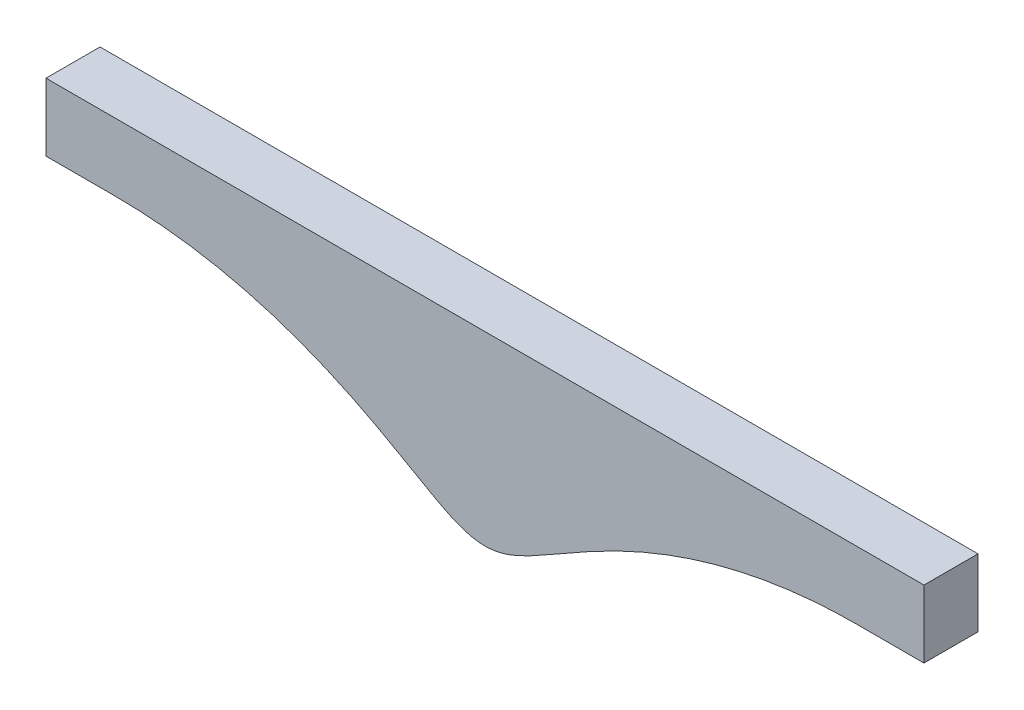
ISO-10303-21;
HEADER;
FILE_DESCRIPTION(('STEP AP214'),'2;1');
FILE_NAME('part.step','',(''),(''),'','','');
FILE_SCHEMA(('AUTOMOTIVE_DESIGN { 1 0 10303 214 1 1 1 1 }'));
ENDSEC;
DATA;
#1=APPLICATION_CONTEXT('core data for automotive mechanical design processes');
#2=APPLICATION_PROTOCOL_DEFINITION('international standard','automotive_design',2000,#1);
#3=PRODUCT_CONTEXT('',#1,'mechanical');
#4=PRODUCT('Part','Part','',(#3));
#5=PRODUCT_RELATED_PRODUCT_CATEGORY('part','',(#4));
#6=PRODUCT_DEFINITION_FORMATION('','',#4);
#7=PRODUCT_DEFINITION_CONTEXT('part definition',#1,'design');
#8=PRODUCT_DEFINITION('design','',#6,#7);
#9=PRODUCT_DEFINITION_SHAPE('','',#8);
#10=(LENGTH_UNIT() NAMED_UNIT(*) SI_UNIT(.MILLI.,.METRE.));
#11=(NAMED_UNIT(*) PLANE_ANGLE_UNIT() SI_UNIT($,.RADIAN.));
#12=(NAMED_UNIT(*) SI_UNIT($,.STERADIAN.) SOLID_ANGLE_UNIT());
#13=UNCERTAINTY_MEASURE_WITH_UNIT(LENGTH_MEASURE(1.E-05),#10,'distance_accuracy_value','');
#14=(GEOMETRIC_REPRESENTATION_CONTEXT(3) GLOBAL_UNCERTAINTY_ASSIGNED_CONTEXT((#13)) GLOBAL_UNIT_ASSIGNED_CONTEXT((#10,
#11,#12)) REPRESENTATION_CONTEXT('',''));
#15=CARTESIAN_POINT('',(0.,0.,0.));
#16=DIRECTION('',(0.,0.,1.));
#17=DIRECTION('',(1.,0.,0.));
#18=AXIS2_PLACEMENT_3D('',#15,#16,#17);
#19=CARTESIAN_POINT('',(0.,46.0374999581832,10.16));
#20=DIRECTION('',(0.,1.,0.));
#21=DIRECTION('',(0.,0.,1.));
#22=AXIS2_PLACEMENT_3D('',#19,#20,#21);
#23=PLANE('',#22);
#24=DIRECTION('',(1.,0.,0.));
#25=VECTOR('',#24,1.);
#26=CARTESIAN_POINT('',(0.,46.0374999581832,0.));
#27=LINE('',#26,#25);
#28=CARTESIAN_POINT('',(-82.5218967264714,46.0374999581832,0.));
#29=VERTEX_POINT('',#28);
#30=CARTESIAN_POINT('',(82.5218967264714,46.0374999581832,0.));
#31=VERTEX_POINT('',#30);
#32=EDGE_CURVE('E124',#29,#31,#27,.T.);
#33=ORIENTED_EDGE('',*,*,#32,.F.);
#34=DIRECTION('',(0.,0.,-1.));
#35=VECTOR('',#34,1.);
#36=CARTESIAN_POINT('',(-82.5218967264714,46.0374999581832,10.16));
#37=LINE('',#36,#35);
#38=CARTESIAN_POINT('',(-82.5218967264714,46.0374999581832,10.16));
#39=VERTEX_POINT('',#38);
#40=EDGE_CURVE('E11',#39,#29,#37,.T.);
#41=ORIENTED_EDGE('',*,*,#40,.F.);
#42=DIRECTION('',(1.,0.,0.));
#43=VECTOR('',#42,1.);
#44=CARTESIAN_POINT('',(0.,46.0374999581832,10.16));
#45=LINE('',#44,#43);
#46=CARTESIAN_POINT('',(82.5218967264714,46.0374999581832,10.16));
#47=VERTEX_POINT('',#46);
#48=EDGE_CURVE('E143',#39,#47,#45,.T.);
#49=ORIENTED_EDGE('',*,*,#48,.T.);
#50=DIRECTION('',(0.,0.,-1.));
#51=VECTOR('',#50,1.);
#52=CARTESIAN_POINT('',(82.5218967264714,46.0374999581832,10.16));
#53=LINE('',#52,#51);
#54=EDGE_CURVE('E56',#47,#31,#53,.T.);
#55=ORIENTED_EDGE('',*,*,#54,.T.);
#56=EDGE_LOOP('',(#33,#41,#49,#55));
#57=FACE_BOUND('',#56,.T.);
#58=ADVANCED_FACE('F40',(#57),#23,.T.);
#59=CARTESIAN_POINT('',(-82.5218967264714,0.,10.16));
#60=DIRECTION('',(-1.,0.,0.));
#61=DIRECTION('',(0.,0.,1.));
#62=AXIS2_PLACEMENT_3D('',#59,#60,#61);
#63=PLANE('',#62);
#64=DIRECTION('',(0.,1.,0.));
#65=VECTOR('',#64,1.);
#66=CARTESIAN_POINT('',(-82.5218967264714,0.,0.));
#67=LINE('',#66,#65);
#68=CARTESIAN_POINT('',(-82.5218967264714,33.3375,0.));
#69=VERTEX_POINT('',#68);
#70=EDGE_CURVE('E126',#69,#29,#67,.T.);
#71=ORIENTED_EDGE('',*,*,#70,.F.);
#72=DIRECTION('',(0.,0.,-1.));
#73=VECTOR('',#72,1.);
#74=CARTESIAN_POINT('',(-82.5218967264714,33.3375,10.16));
#75=LINE('',#74,#73);
#76=CARTESIAN_POINT('',(-82.5218967264714,33.3375,10.16));
#77=VERTEX_POINT('',#76);
#78=EDGE_CURVE('E48',#77,#69,#75,.T.);
#79=ORIENTED_EDGE('',*,*,#78,.F.);
#80=DIRECTION('',(0.,1.,0.));
#81=VECTOR('',#80,1.);
#82=CARTESIAN_POINT('',(-82.5218967264714,0.,10.16));
#83=LINE('',#82,#81);
#84=EDGE_CURVE('E230',#77,#39,#83,.T.);
#85=ORIENTED_EDGE('',*,*,#84,.T.);
#86=ORIENTED_EDGE('',*,*,#40,.T.);
#87=EDGE_LOOP('',(#71,#79,#85,#86));
#88=FACE_BOUND('',#87,.T.);
#89=ADVANCED_FACE('F152',(#88),#63,.T.);
#90=CARTESIAN_POINT('',(0.,33.3375,10.16));
#91=DIRECTION('',(0.,-1.,0.));
#92=DIRECTION('',(0.,0.,-1.));
#93=AXIS2_PLACEMENT_3D('',#90,#91,#92);
#94=PLANE('',#93);
#95=DIRECTION('',(-1.,0.,0.));
#96=VECTOR('',#95,1.);
#97=CARTESIAN_POINT('',(0.,33.3375,0.));
#98=LINE('',#97,#96);
#99=CARTESIAN_POINT('',(-69.8218967264714,33.3375,0.));
#100=VERTEX_POINT('',#99);
#101=EDGE_CURVE('E129',#100,#69,#98,.T.);
#102=ORIENTED_EDGE('',*,*,#101,.F.);
#103=DIRECTION('',(0.,0.,-1.));
#104=VECTOR('',#103,1.);
#105=CARTESIAN_POINT('',(-69.8218967264714,33.3375,10.16));
#106=LINE('',#105,#104);
#107=CARTESIAN_POINT('',(-69.8218967264714,33.3375,10.16));
#108=VERTEX_POINT('',#107);
#109=EDGE_CURVE('E113',#108,#100,#106,.T.);
#110=ORIENTED_EDGE('',*,*,#109,.F.);
#111=DIRECTION('',(-1.,0.,0.));
#112=VECTOR('',#111,1.);
#113=CARTESIAN_POINT('',(0.,33.3375,10.16));
#114=LINE('',#113,#112);
#115=EDGE_CURVE('E103',#108,#77,#114,.T.);
#116=ORIENTED_EDGE('',*,*,#115,.T.);
#117=ORIENTED_EDGE('',*,*,#78,.T.);
#118=EDGE_LOOP('',(#102,#110,#116,#117));
#119=FACE_BOUND('',#118,.T.);
#120=ADVANCED_FACE('F149',(#119),#94,.T.);
#121=CARTESIAN_POINT('',(-69.8218967264858,33.3374999580635,10.16));
#122=CARTESIAN_POINT('',(-69.6957480818448,33.3374999580626,10.16));
#123=CARTESIAN_POINT('',(-69.4440148782392,33.3368889795227,10.16));
#124=CARTESIAN_POINT('',(-68.9747764542418,33.3341395761267,10.16));
#125=CARTESIAN_POINT('',(-68.3115236107015,33.3268079678238,10.16));
#126=CARTESIAN_POINT('',(-67.5357386455212,33.3130616224356,10.16));
#127=CARTESIAN_POINT('',(-66.6498717909406,33.2892358791373,10.16));
#128=CARTESIAN_POINT('',(-65.5831199659768,33.2507517694854,10.16));
#129=CARTESIAN_POINT('',(-64.3751091339763,33.192119397511,10.16));
#130=CARTESIAN_POINT('',(-63.1660654764822,33.1188452326633,10.16));
#131=CARTESIAN_POINT('',(-61.9582577553669,33.0309401922467,10.16));
#132=CARTESIAN_POINT('',(-60.7515618300229,32.9284177246184,10.16));
#133=CARTESIAN_POINT('',(-58.3408581977653,32.6941687127647,10.16));
#134=CARTESIAN_POINT('',(-55.636700095352,32.3540769309137,10.16));
#135=CARTESIAN_POINT('',(-52.0474661500314,31.7844379814137,10.16));
#136=CARTESIAN_POINT('',(-47.5972592946869,30.8744221696447,10.16));
#137=CARTESIAN_POINT('',(-44.0686831453045,30.003709231308,10.16));
#138=CARTESIAN_POINT('',(-40.5783197709953,28.9927510350897,10.16));
#139=CARTESIAN_POINT('',(-37.6982574037094,28.0585127048444,10.16));
#140=CARTESIAN_POINT('',(-35.412490366884,27.2569287352259,10.16));
#141=CARTESIAN_POINT('',(-33.1461126209444,26.4021097833041,10.16));
#142=CARTESIAN_POINT('',(-30.8999890938402,25.4953912017431,10.16));
#143=CARTESIAN_POINT('',(-28.1187138146555,24.2988185055556,10.16));
#144=CARTESIAN_POINT('',(-24.8241372039684,22.7660023023749,10.16));
#145=CARTESIAN_POINT('',(-21.0442635983456,20.8459930759222,10.16));
#146=CARTESIAN_POINT('',(-16.9884950648664,18.6048841973861,10.16));
#147=CARTESIAN_POINT('',(-13.1639222421827,16.3849980589238,10.16));
#148=CARTESIAN_POINT('',(-9.68243377420085,14.3781100326795,10.16));
#149=CARTESIAN_POINT('',(-6.75276668306141,12.8393701637596,10.16));
#150=CARTESIAN_POINT('',(-4.26057503062613,11.8187737824929,10.16));
#151=CARTESIAN_POINT('',(-2.28964899715533,11.3000200368692,10.16));
#152=CARTESIAN_POINT('',(-0.72751329516515,11.0981554906421,10.16));
#153=CARTESIAN_POINT('',(0.727513364766171,11.098155138696,10.16));
#154=CARTESIAN_POINT('',(2.28964876853395,11.3000205078454,10.16));
#155=CARTESIAN_POINT('',(4.26057554411917,11.8187729466673,10.16));
#156=CARTESIAN_POINT('',(6.75276557928204,12.8393718219673,10.16));
#157=CARTESIAN_POINT('',(9.682435908312,14.3781069205734,10.16));
#158=CARTESIAN_POINT('',(13.1639184526393,16.385003516972,10.16));
#159=CARTESIAN_POINT('',(16.9885013505193,18.6048751754403,10.16));
#160=CARTESIAN_POINT('',(21.0442529817893,20.8460083199345,10.16));
#161=CARTESIAN_POINT('',(25.3641380033682,23.0402626429641,10.16));
#162=CARTESIAN_POINT('',(29.2205205498386,24.802279565434,10.16));
#163=CARTESIAN_POINT('',(32.5794991489081,26.1884459147826,10.16));
#164=CARTESIAN_POINT('',(35.4124949090145,27.2569092682592,10.16));
#165=CARTESIAN_POINT('',(37.6982652307199,28.058522907698,10.16));
#166=CARTESIAN_POINT('',(40.5782972547958,28.9927445048182,10.16));
#167=CARTESIAN_POINT('',(44.0687289705546,30.0037139495391,10.16));
#168=CARTESIAN_POINT('',(48.1852724640372,31.0195371633303,10.16));
#169=CARTESIAN_POINT('',(52.3463685432274,31.8355951437173,10.16));
#170=CARTESIAN_POINT('',(55.937275824499,32.3906627347118,10.16));
#171=CARTESIAN_POINT('',(58.9433730684494,32.7563707759698,10.16));
#172=CARTESIAN_POINT('',(61.3533261541599,32.990636746418,10.16));
#173=CARTESIAN_POINT('',(63.4691074651729,33.1444827392449,10.16));
#174=CARTESIAN_POINT('',(65.2794253186524,33.2397561752903,10.16));
#175=CARTESIAN_POINT('',(66.6495159702173,33.2892359301117,10.16));
#176=CARTESIAN_POINT('',(67.5357843412672,33.313061615046,10.16));
#177=CARTESIAN_POINT('',(68.311545277597,33.3268079643279,10.16));
#178=CARTESIAN_POINT('',(68.9747732289001,33.3341395756308,10.16));
#179=CARTESIAN_POINT('',(69.4440183744134,33.3368889795814,10.16));
#180=CARTESIAN_POINT('',(69.6957480818322,33.3374999581823,10.16));
#181=CARTESIAN_POINT('',(69.8218967265757,33.3374999581832,10.16));
#182=B_SPLINE_CURVE_WITH_KNOTS('',4,(#121,#122,#123,#124,#125,#126,#127,#128,#129,#130,#131,
#132,#133,#134,#135,#136,#137,#138,#139,#140,#141,#142,#143,#144,#145,#146,#147,#148,#149,#150,
#151,#152,#153,#154,#155,#156,#157,#158,#159,#160,#161,#162,#163,#164,#165,#166,#167,#168,#169,
#170,#171,#172,#173,#174,#175,#176,#177,#178,#179,#180,#181),.UNSPECIFIED.,.F.,.F.,(5,1,1,1,1,1,
1,1,1,1,1,1,1,1,1,1,1,1,1,1,1,1,1,1,1,1,1,1,1,1,1,1,1,1,1,1,1,1,1,1,1,1,1,1,1,1,1,1,1,1,1,1,1,1,
1,1,1,5),(0.0833255309483195,0.0867230770798469,0.0901206232113743,0.0935181693429017,
0.0969157154744291,0.103710807737484,0.110505900000539,0.117300992263594,0.124096084526648,
0.130891176789703,0.137686269052758,0.144481359523297,0.17845681187599,0.192046992817067,
0.219227344335749,0.246407695854431,0.259997927537568,0.273588159220704,0.287178390903841,
0.300768622586978,0.314358810612842,0.327948998638706,0.355129374690434,0.382309727752623,
0.409490080814812,0.431935904471417,0.454381728128022,0.472501988363193,0.483716790698197,
0.492234559457799,0.500000000000001,0.507765440542204,0.516283209301805,0.527498011636808,
0.545618271871975,0.568064095528576,0.590509919185177,0.617690272247366,0.644870625309554,
0.672051001361282,0.69923137741301,0.712821609096146,0.726411840779282,0.740002072462418,
0.753592304145555,0.780772655664236,0.807953007182918,0.835133369065072,0.848723550006149,
0.862313730947226,0.87590391547334,0.889494099999453,0.89628919226251,0.903084284525567,
0.906481830657096,0.909879376788624,0.913276922920152,0.916674469051681),.UNSPECIFIED.);
#183=DIRECTION('',(0.,0.,-1.));
#184=VECTOR('',#183,1.);
#185=SURFACE_OF_LINEAR_EXTRUSION('',#182,#184);
#186=CARTESIAN_POINT('',(-69.8218967264858,33.3374999580635,0.));
#187=CARTESIAN_POINT('',(-69.6957480818448,33.3374999580626,0.));
#188=CARTESIAN_POINT('',(-69.4440148782392,33.3368889795227,0.));
#189=CARTESIAN_POINT('',(-68.9747764542418,33.3341395761267,0.));
#190=CARTESIAN_POINT('',(-68.3115236107015,33.3268079678238,0.));
#191=CARTESIAN_POINT('',(-67.5357386455212,33.3130616224356,0.));
#192=CARTESIAN_POINT('',(-66.6498717909406,33.2892358791373,0.));
#193=CARTESIAN_POINT('',(-65.5831199659768,33.2507517694854,0.));
#194=CARTESIAN_POINT('',(-64.3751091339763,33.192119397511,0.));
#195=CARTESIAN_POINT('',(-63.1660654764822,33.1188452326633,0.));
#196=CARTESIAN_POINT('',(-61.9582577553669,33.0309401922467,0.));
#197=CARTESIAN_POINT('',(-60.7515618300229,32.9284177246184,0.));
#198=CARTESIAN_POINT('',(-58.3408581977653,32.6941687127647,0.));
#199=CARTESIAN_POINT('',(-55.636700095352,32.3540769309137,0.));
#200=CARTESIAN_POINT('',(-52.0474661500314,31.7844379814137,0.));
#201=CARTESIAN_POINT('',(-47.5972592946869,30.8744221696447,0.));
#202=CARTESIAN_POINT('',(-44.0686831453045,30.003709231308,0.));
#203=CARTESIAN_POINT('',(-40.5783197709953,28.9927510350897,0.));
#204=CARTESIAN_POINT('',(-37.6982574037094,28.0585127048444,0.));
#205=CARTESIAN_POINT('',(-35.412490366884,27.2569287352259,0.));
#206=CARTESIAN_POINT('',(-33.1461126209444,26.4021097833041,0.));
#207=CARTESIAN_POINT('',(-30.8999890938402,25.4953912017431,0.));
#208=CARTESIAN_POINT('',(-28.1187138146555,24.2988185055556,0.));
#209=CARTESIAN_POINT('',(-24.8241372039684,22.7660023023749,0.));
#210=CARTESIAN_POINT('',(-21.0442635983456,20.8459930759222,0.));
#211=CARTESIAN_POINT('',(-16.9884950648664,18.6048841973861,0.));
#212=CARTESIAN_POINT('',(-13.1639222421827,16.3849980589238,0.));
#213=CARTESIAN_POINT('',(-9.68243377420085,14.3781100326795,0.));
#214=CARTESIAN_POINT('',(-6.75276668306141,12.8393701637596,0.));
#215=CARTESIAN_POINT('',(-4.26057503062613,11.8187737824929,0.));
#216=CARTESIAN_POINT('',(-2.28964899715533,11.3000200368692,0.));
#217=CARTESIAN_POINT('',(-0.72751329516515,11.0981554906421,0.));
#218=CARTESIAN_POINT('',(0.727513364766171,11.098155138696,0.));
#219=CARTESIAN_POINT('',(2.28964876853395,11.3000205078454,0.));
#220=CARTESIAN_POINT('',(4.26057554411917,11.8187729466673,0.));
#221=CARTESIAN_POINT('',(6.75276557928204,12.8393718219673,0.));
#222=CARTESIAN_POINT('',(9.682435908312,14.3781069205734,0.));
#223=CARTESIAN_POINT('',(13.1639184526393,16.385003516972,0.));
#224=CARTESIAN_POINT('',(16.9885013505193,18.6048751754403,0.));
#225=CARTESIAN_POINT('',(21.0442529817893,20.8460083199345,0.));
#226=CARTESIAN_POINT('',(25.3641380033682,23.0402626429641,0.));
#227=CARTESIAN_POINT('',(29.2205205498386,24.802279565434,0.));
#228=CARTESIAN_POINT('',(32.5794991489081,26.1884459147826,0.));
#229=CARTESIAN_POINT('',(35.4124949090145,27.2569092682592,0.));
#230=CARTESIAN_POINT('',(37.6982652307199,28.058522907698,0.));
#231=CARTESIAN_POINT('',(40.5782972547958,28.9927445048182,0.));
#232=CARTESIAN_POINT('',(44.0687289705546,30.0037139495391,0.));
#233=CARTESIAN_POINT('',(48.1852724640372,31.0195371633303,0.));
#234=CARTESIAN_POINT('',(52.3463685432274,31.8355951437173,0.));
#235=CARTESIAN_POINT('',(55.937275824499,32.3906627347118,0.));
#236=CARTESIAN_POINT('',(58.9433730684494,32.7563707759698,0.));
#237=CARTESIAN_POINT('',(61.3533261541599,32.990636746418,0.));
#238=CARTESIAN_POINT('',(63.4691074651729,33.1444827392449,0.));
#239=CARTESIAN_POINT('',(65.2794253186524,33.2397561752903,0.));
#240=CARTESIAN_POINT('',(66.6495159702173,33.2892359301117,0.));
#241=CARTESIAN_POINT('',(67.5357843412672,33.313061615046,0.));
#242=CARTESIAN_POINT('',(68.311545277597,33.3268079643279,0.));
#243=CARTESIAN_POINT('',(68.9747732289001,33.3341395756308,0.));
#244=CARTESIAN_POINT('',(69.4440183744134,33.3368889795814,0.));
#245=CARTESIAN_POINT('',(69.6957480818322,33.3374999581823,0.));
#246=CARTESIAN_POINT('',(69.8218967265757,33.3374999581832,0.));
#247=B_SPLINE_CURVE_WITH_KNOTS('',4,(#186,#187,#188,#189,#190,#191,#192,#193,#194,#195,#196,
#197,#198,#199,#200,#201,#202,#203,#204,#205,#206,#207,#208,#209,#210,#211,#212,#213,#214,#215,
#216,#217,#218,#219,#220,#221,#222,#223,#224,#225,#226,#227,#228,#229,#230,#231,#232,#233,#234,
#235,#236,#237,#238,#239,#240,#241,#242,#243,#244,#245,#246),.UNSPECIFIED.,.F.,.F.,(5,1,1,1,1,1,
1,1,1,1,1,1,1,1,1,1,1,1,1,1,1,1,1,1,1,1,1,1,1,1,1,1,1,1,1,1,1,1,1,1,1,1,1,1,1,1,1,1,1,1,1,1,1,1,
1,1,1,5),(0.0833255309483195,0.0867230770798469,0.0901206232113743,0.0935181693429017,
0.0969157154744291,0.103710807737484,0.110505900000539,0.117300992263594,0.124096084526648,
0.130891176789703,0.137686269052758,0.144481359523297,0.17845681187599,0.192046992817067,
0.219227344335749,0.246407695854431,0.259997927537568,0.273588159220704,0.287178390903841,
0.300768622586978,0.314358810612842,0.327948998638706,0.355129374690434,0.382309727752623,
0.409490080814812,0.431935904471417,0.454381728128022,0.472501988363193,0.483716790698197,
0.492234559457799,0.500000000000001,0.507765440542204,0.516283209301805,0.527498011636808,
0.545618271871975,0.568064095528576,0.590509919185177,0.617690272247366,0.644870625309554,
0.672051001361282,0.69923137741301,0.712821609096146,0.726411840779282,0.740002072462418,
0.753592304145555,0.780772655664236,0.807953007182918,0.835133369065072,0.848723550006149,
0.862313730947226,0.87590391547334,0.889494099999453,0.89628919226251,0.903084284525567,
0.906481830657096,0.909879376788624,0.913276922920152,0.916674469051681),.UNSPECIFIED.);
#248=CARTESIAN_POINT('',(69.8218967264714,33.3374999581832,0.));
#249=VERTEX_POINT('',#248);
#250=EDGE_CURVE('E110',#100,#249,#247,.T.);
#251=ORIENTED_EDGE('',*,*,#250,.T.);
#252=DIRECTION('',(0.,0.,-1.));
#253=VECTOR('',#252,1.);
#254=CARTESIAN_POINT('',(69.8218967264714,33.3374999581832,10.16));
#255=LINE('',#254,#253);
#256=CARTESIAN_POINT('',(69.8218967264714,33.3374999581832,10.16));
#257=VERTEX_POINT('',#256);
#258=EDGE_CURVE('E107',#257,#249,#255,.T.);
#259=ORIENTED_EDGE('',*,*,#258,.F.);
#260=EDGE_CURVE('E95',#108,#257,#182,.T.);
#261=ORIENTED_EDGE('',*,*,#260,.F.);
#262=ORIENTED_EDGE('',*,*,#109,.T.);
#263=EDGE_LOOP('',(#251,#259,#261,#262));
#264=FACE_BOUND('',#263,.T.);
#265=ADVANCED_FACE('F108',(#264),#185,.F.);
#266=CARTESIAN_POINT('',(0.,33.3374999581832,10.16));
#267=DIRECTION('',(0.,1.,0.));
#268=DIRECTION('',(0.,0.,1.));
#269=AXIS2_PLACEMENT_3D('',#266,#267,#268);
#270=PLANE('',#269);
#271=DIRECTION('',(1.,0.,0.));
#272=VECTOR('',#271,1.);
#273=CARTESIAN_POINT('',(0.,33.3374999581832,0.));
#274=LINE('',#273,#272);
#275=CARTESIAN_POINT('',(82.5218967264714,33.3374999581832,0.));
#276=VERTEX_POINT('',#275);
#277=EDGE_CURVE('E135',#249,#276,#274,.T.);
#278=ORIENTED_EDGE('',*,*,#277,.T.);
#279=DIRECTION('',(0.,0.,-1.));
#280=VECTOR('',#279,1.);
#281=CARTESIAN_POINT('',(82.5218967264714,33.3374999581832,10.16));
#282=LINE('',#281,#280);
#283=CARTESIAN_POINT('',(82.5218967264714,33.3374999581832,10.16));
#284=VERTEX_POINT('',#283);
#285=EDGE_CURVE('E76',#284,#276,#282,.T.);
#286=ORIENTED_EDGE('',*,*,#285,.F.);
#287=DIRECTION('',(1.,0.,0.));
#288=VECTOR('',#287,1.);
#289=CARTESIAN_POINT('',(0.,33.3374999581832,10.16));
#290=LINE('',#289,#288);
#291=EDGE_CURVE('E100',#257,#284,#290,.T.);
#292=ORIENTED_EDGE('',*,*,#291,.F.);
#293=ORIENTED_EDGE('',*,*,#258,.T.);
#294=EDGE_LOOP('',(#278,#286,#292,#293));
#295=FACE_BOUND('',#294,.T.);
#296=ADVANCED_FACE('F115',(#295),#270,.F.);
#297=CARTESIAN_POINT('',(82.5218967264714,0.,10.16));
#298=DIRECTION('',(1.,0.,0.));
#299=DIRECTION('',(0.,0.,-1.));
#300=AXIS2_PLACEMENT_3D('',#297,#298,#299);
#301=PLANE('',#300);
#302=DIRECTION('',(0.,-1.,0.));
#303=VECTOR('',#302,1.);
#304=CARTESIAN_POINT('',(82.5218967264714,0.,0.));
#305=LINE('',#304,#303);
#306=EDGE_CURVE('E140',#31,#276,#305,.T.);
#307=ORIENTED_EDGE('',*,*,#306,.F.);
#308=ORIENTED_EDGE('',*,*,#54,.F.);
#309=DIRECTION('',(0.,-1.,0.));
#310=VECTOR('',#309,1.);
#311=CARTESIAN_POINT('',(82.5218967264714,0.,10.16));
#312=LINE('',#311,#310);
#313=EDGE_CURVE('E116',#47,#284,#312,.T.);
#314=ORIENTED_EDGE('',*,*,#313,.T.);
#315=ORIENTED_EDGE('',*,*,#285,.T.);
#316=EDGE_LOOP('',(#307,#308,#314,#315));
#317=FACE_BOUND('',#316,.T.);
#318=ADVANCED_FACE('F155',(#317),#301,.T.);
#319=CARTESIAN_POINT('',(0.,0.,10.16));
#320=DIRECTION('',(0.,0.,1.));
#321=DIRECTION('',(1.,0.,0.));
#322=AXIS2_PLACEMENT_3D('',#319,#320,#321);
#323=PLANE('',#322);
#324=ORIENTED_EDGE('',*,*,#48,.F.);
#325=ORIENTED_EDGE('',*,*,#84,.F.);
#326=ORIENTED_EDGE('',*,*,#115,.F.);
#327=ORIENTED_EDGE('',*,*,#260,.T.);
#328=ORIENTED_EDGE('',*,*,#291,.T.);
#329=ORIENTED_EDGE('',*,*,#313,.F.);
#330=EDGE_LOOP('',(#324,#325,#326,#327,#328,#329));
#331=FACE_BOUND('',#330,.T.);
#332=ADVANCED_FACE('F97',(#331),#323,.T.);
#333=CARTESIAN_POINT('',(0.,0.,0.));
#334=DIRECTION('',(0.,0.,1.));
#335=DIRECTION('',(1.,0.,0.));
#336=AXIS2_PLACEMENT_3D('',#333,#334,#335);
#337=PLANE('',#336);
#338=ORIENTED_EDGE('',*,*,#32,.T.);
#339=ORIENTED_EDGE('',*,*,#306,.T.);
#340=ORIENTED_EDGE('',*,*,#277,.F.);
#341=ORIENTED_EDGE('',*,*,#250,.F.);
#342=ORIENTED_EDGE('',*,*,#101,.T.);
#343=ORIENTED_EDGE('',*,*,#70,.T.);
#344=EDGE_LOOP('',(#338,#339,#340,#341,#342,#343));
#345=FACE_BOUND('',#344,.T.);
#346=ADVANCED_FACE('F154',(#345),#337,.F.);
#347=CLOSED_SHELL('',(#58,#89,#120,#265,#296,#318,#332,#346));
#348=MANIFOLD_SOLID_BREP('B2',#347);
#349=ADVANCED_BREP_SHAPE_REPRESENTATION('',(#18,#348),#14);
#350=SHAPE_DEFINITION_REPRESENTATION(#9,#349);
ENDSEC;
END-ISO-10303-21;
